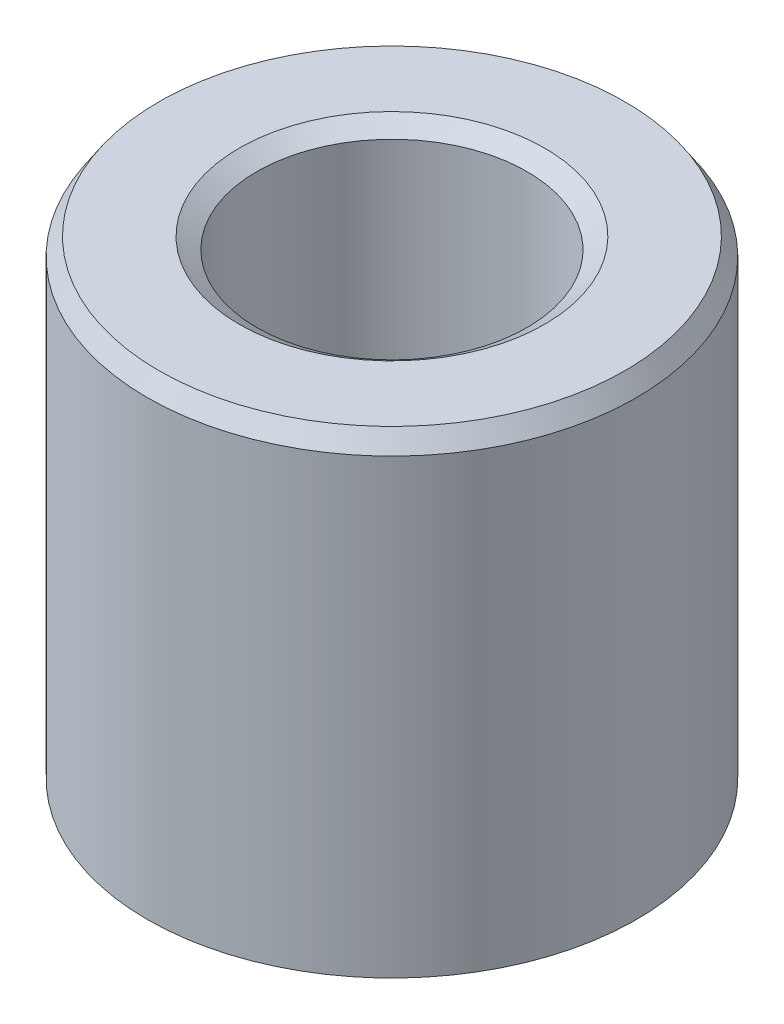
ISO-10303-21;
HEADER;
FILE_DESCRIPTION(('STEP AP214'),'2;1');
FILE_NAME('part.step','',(''),(''),'','','');
FILE_SCHEMA(('AUTOMOTIVE_DESIGN { 1 0 10303 214 1 1 1 1 }'));
ENDSEC;
DATA;
#1=APPLICATION_CONTEXT('core data for automotive mechanical design processes');
#2=APPLICATION_PROTOCOL_DEFINITION('international standard','automotive_design',2000,#1);
#3=PRODUCT_CONTEXT('',#1,'mechanical');
#4=PRODUCT('Part','Part','',(#3));
#5=PRODUCT_RELATED_PRODUCT_CATEGORY('part','',(#4));
#6=PRODUCT_DEFINITION_FORMATION('','',#4);
#7=PRODUCT_DEFINITION_CONTEXT('part definition',#1,'design');
#8=PRODUCT_DEFINITION('design','',#6,#7);
#9=PRODUCT_DEFINITION_SHAPE('','',#8);
#10=(LENGTH_UNIT() NAMED_UNIT(*) SI_UNIT(.MILLI.,.METRE.));
#11=(NAMED_UNIT(*) PLANE_ANGLE_UNIT() SI_UNIT($,.RADIAN.));
#12=(NAMED_UNIT(*) SI_UNIT($,.STERADIAN.) SOLID_ANGLE_UNIT());
#13=UNCERTAINTY_MEASURE_WITH_UNIT(LENGTH_MEASURE(1.E-05),#10,'distance_accuracy_value','');
#14=(GEOMETRIC_REPRESENTATION_CONTEXT(3) GLOBAL_UNCERTAINTY_ASSIGNED_CONTEXT((#13)) GLOBAL_UNIT_ASSIGNED_CONTEXT((#10,
#11,#12)) REPRESENTATION_CONTEXT('',''));
#15=CARTESIAN_POINT('',(0.,0.,0.));
#16=DIRECTION('',(0.,0.,1.));
#17=DIRECTION('',(1.,0.,0.));
#18=AXIS2_PLACEMENT_3D('',#15,#16,#17);
#19=CARTESIAN_POINT('',(0.,88.5319245977185,0.));
#20=DIRECTION('',(0.,-1.,0.));
#21=DIRECTION('',(0.,0.,-1.));
#22=AXIS2_PLACEMENT_3D('',#19,#20,#21);
#23=CYLINDRICAL_SURFACE('',#22,45.);
#24=CARTESIAN_POINT('',(0.,2.13009297990127,0.));
#25=DIRECTION('',(0.,1.,0.));
#26=DIRECTION('',(0.,0.,1.));
#27=AXIS2_PLACEMENT_3D('',#24,#25,#26);
#28=CIRCLE('',#27,45.);
#29=CARTESIAN_POINT('',(0.,2.13009297990127,45.));
#30=VERTEX_POINT('',#29);
#31=EDGE_CURVE('E10',#30,#30,#28,.T.);
#32=ORIENTED_EDGE('',*,*,#31,.T.);
#33=EDGE_LOOP('',(#32));
#34=FACE_BOUND('',#33,.T.);
#35=CARTESIAN_POINT('',(0.,85.3036441424034,0.));
#36=DIRECTION('',(0.,1.,0.));
#37=DIRECTION('',(0.,0.,1.));
#38=AXIS2_PLACEMENT_3D('',#35,#36,#37);
#39=CIRCLE('',#38,45.);
#40=CARTESIAN_POINT('',(0.,85.3036441424034,45.));
#41=VERTEX_POINT('',#40);
#42=EDGE_CURVE('E50',#41,#41,#39,.F.);
#43=ORIENTED_EDGE('',*,*,#42,.T.);
#44=EDGE_LOOP('',(#43));
#45=FACE_BOUND('',#44,.T.);
#46=ADVANCED_FACE('F39',(#34,#45),#23,.T.);
#47=CARTESIAN_POINT('',(0.,88.5319245977185,0.));
#48=DIRECTION('',(0.,1.,0.));
#49=DIRECTION('',(0.,0.,1.));
#50=AXIS2_PLACEMENT_3D('',#47,#48,#49);
#51=PLANE('',#50);
#52=CARTESIAN_POINT('',(0.,88.5319245977185,0.));
#53=DIRECTION('',(0.,1.,0.));
#54=DIRECTION('',(0.,0.,1.));
#55=AXIS2_PLACEMENT_3D('',#52,#53,#54);
#56=CIRCLE('',#55,28.0979489694482);
#57=CARTESIAN_POINT('',(0.,88.5319245977185,28.0979489694482));
#58=VERTEX_POINT('',#57);
#59=EDGE_CURVE('E58',#58,#58,#56,.F.);
#60=ORIENTED_EDGE('',*,*,#59,.T.);
#61=EDGE_LOOP('',(#60));
#62=FACE_BOUND('',#61,.T.);
#63=CARTESIAN_POINT('',(0.,88.5319245977185,0.));
#64=DIRECTION('',(0.,1.,0.));
#65=DIRECTION('',(0.,0.,1.));
#66=AXIS2_PLACEMENT_3D('',#63,#64,#65);
#67=CIRCLE('',#66,42.8699070200988);
#68=CARTESIAN_POINT('',(0.,88.5319245977185,42.8699070200988));
#69=VERTEX_POINT('',#68);
#70=EDGE_CURVE('E61',#69,#69,#67,.T.);
#71=ORIENTED_EDGE('',*,*,#70,.T.);
#72=EDGE_LOOP('',(#71));
#73=FACE_BOUND('',#72,.T.);
#74=ADVANCED_FACE('F88',(#62,#73),#51,.T.);
#75=CARTESIAN_POINT('',(0.,0.,0.));
#76=DIRECTION('',(0.,1.,0.));
#77=DIRECTION('',(0.,0.,1.));
#78=AXIS2_PLACEMENT_3D('',#75,#76,#77);
#79=PLANE('',#78);
#80=CARTESIAN_POINT('',(0.,0.,0.));
#81=DIRECTION('',(0.,1.,0.));
#82=DIRECTION('',(0.,0.,1.));
#83=AXIS2_PLACEMENT_3D('',#80,#81,#82);
#84=CIRCLE('',#83,26.9997614940343);
#85=CARTESIAN_POINT('',(0.,0.,26.9997614940343));
#86=VERTEX_POINT('',#85);
#87=EDGE_CURVE('E51',#86,#86,#84,.T.);
#88=ORIENTED_EDGE('',*,*,#87,.T.);
#89=EDGE_LOOP('',(#88));
#90=FACE_BOUND('',#89,.T.);
#91=CARTESIAN_POINT('',(0.,0.,0.));
#92=DIRECTION('',(0.,1.,0.));
#93=DIRECTION('',(0.,0.,1.));
#94=AXIS2_PLACEMENT_3D('',#91,#92,#93);
#95=CIRCLE('',#94,41.7717195446849);
#96=CARTESIAN_POINT('',(0.,0.,41.7717195446849));
#97=VERTEX_POINT('',#96);
#98=EDGE_CURVE('E54',#97,#97,#95,.F.);
#99=ORIENTED_EDGE('',*,*,#98,.T.);
#100=EDGE_LOOP('',(#99));
#101=FACE_BOUND('',#100,.T.);
#102=ADVANCED_FACE('F83',(#90,#101),#79,.F.);
#103=CARTESIAN_POINT('',(0.,88.5319245977185,0.));
#104=DIRECTION('',(0.,-1.,0.));
#105=DIRECTION('',(0.,0.,-1.));
#106=AXIS2_PLACEMENT_3D('',#103,#104,#105);
#107=CYLINDRICAL_SURFACE('',#106,24.869668514133);
#108=CARTESIAN_POINT('',(0.,86.4018316178172,0.));
#109=DIRECTION('',(0.,1.,0.));
#110=DIRECTION('',(0.,0.,1.));
#111=AXIS2_PLACEMENT_3D('',#108,#109,#110);
#112=CIRCLE('',#111,24.869668514133);
#113=CARTESIAN_POINT('',(0.,86.4018316178172,24.869668514133));
#114=VERTEX_POINT('',#113);
#115=EDGE_CURVE('E67',#114,#114,#112,.T.);
#116=ORIENTED_EDGE('',*,*,#115,.T.);
#117=EDGE_LOOP('',(#116));
#118=FACE_BOUND('',#117,.T.);
#119=CARTESIAN_POINT('',(0.,3.22828045531509,0.));
#120=DIRECTION('',(0.,1.,0.));
#121=DIRECTION('',(0.,0.,1.));
#122=AXIS2_PLACEMENT_3D('',#119,#120,#121);
#123=CIRCLE('',#122,24.869668514133);
#124=CARTESIAN_POINT('',(0.,3.22828045531509,24.869668514133));
#125=VERTEX_POINT('',#124);
#126=EDGE_CURVE('E69',#125,#125,#123,.F.);
#127=ORIENTED_EDGE('',*,*,#126,.T.);
#128=EDGE_LOOP('',(#127));
#129=FACE_BOUND('',#128,.T.);
#130=ADVANCED_FACE('F71',(#118,#129),#107,.F.);
#131=CARTESIAN_POINT('',(0.,86.4018316178172,0.));
#132=DIRECTION('',(0.,1.,0.));
#133=DIRECTION('',(0.,0.,1.));
#134=AXIS2_PLACEMENT_3D('',#131,#132,#133);
#135=CONICAL_SURFACE('',#134,24.869668514133,0.987546777525424);
#136=ORIENTED_EDGE('',*,*,#59,.F.);
#137=EDGE_LOOP('',(#136));
#138=FACE_BOUND('',#137,.T.);
#139=ORIENTED_EDGE('',*,*,#115,.F.);
#140=EDGE_LOOP('',(#139));
#141=FACE_BOUND('',#140,.T.);
#142=ADVANCED_FACE('F77',(#138,#141),#135,.F.);
#143=CARTESIAN_POINT('',(0.,0.,0.));
#144=DIRECTION('',(0.,-1.,0.));
#145=DIRECTION('',(0.,0.,-1.));
#146=AXIS2_PLACEMENT_3D('',#143,#144,#145);
#147=CONICAL_SURFACE('',#146,26.9997614940343,0.583249549269475);
#148=ORIENTED_EDGE('',*,*,#126,.F.);
#149=EDGE_LOOP('',(#148));
#150=FACE_BOUND('',#149,.T.);
#151=ORIENTED_EDGE('',*,*,#87,.F.);
#152=EDGE_LOOP('',(#151));
#153=FACE_BOUND('',#152,.T.);
#154=ADVANCED_FACE('F73',(#150,#153),#147,.F.);
#155=CARTESIAN_POINT('',(0.,2.13009297990127,0.));
#156=DIRECTION('',(0.,1.,0.));
#157=DIRECTION('',(0.,0.,1.));
#158=AXIS2_PLACEMENT_3D('',#155,#156,#157);
#159=CONICAL_SURFACE('',#158,45.,0.987546777525423);
#160=ORIENTED_EDGE('',*,*,#98,.F.);
#161=EDGE_LOOP('',(#160));
#162=FACE_BOUND('',#161,.T.);
#163=ORIENTED_EDGE('',*,*,#31,.F.);
#164=EDGE_LOOP('',(#163));
#165=FACE_BOUND('',#164,.T.);
#166=ADVANCED_FACE('F76',(#162,#165),#159,.T.);
#167=CARTESIAN_POINT('',(0.,88.5319245977185,0.));
#168=DIRECTION('',(0.,-1.,0.));
#169=DIRECTION('',(0.,0.,-1.));
#170=AXIS2_PLACEMENT_3D('',#167,#168,#169);
#171=CONICAL_SURFACE('',#170,42.8699070200988,0.583249549269469);
#172=ORIENTED_EDGE('',*,*,#42,.F.);
#173=EDGE_LOOP('',(#172));
#174=FACE_BOUND('',#173,.T.);
#175=ORIENTED_EDGE('',*,*,#70,.F.);
#176=EDGE_LOOP('',(#175));
#177=FACE_BOUND('',#176,.T.);
#178=ADVANCED_FACE('F45',(#174,#177),#171,.T.);
#179=CLOSED_SHELL('',(#46,#74,#102,#130,#142,#154,#166,#178));
#180=MANIFOLD_SOLID_BREP('B2',#179);
#181=ADVANCED_BREP_SHAPE_REPRESENTATION('',(#18,#180),#14);
#182=SHAPE_DEFINITION_REPRESENTATION(#9,#181);
ENDSEC;
END-ISO-10303-21;
